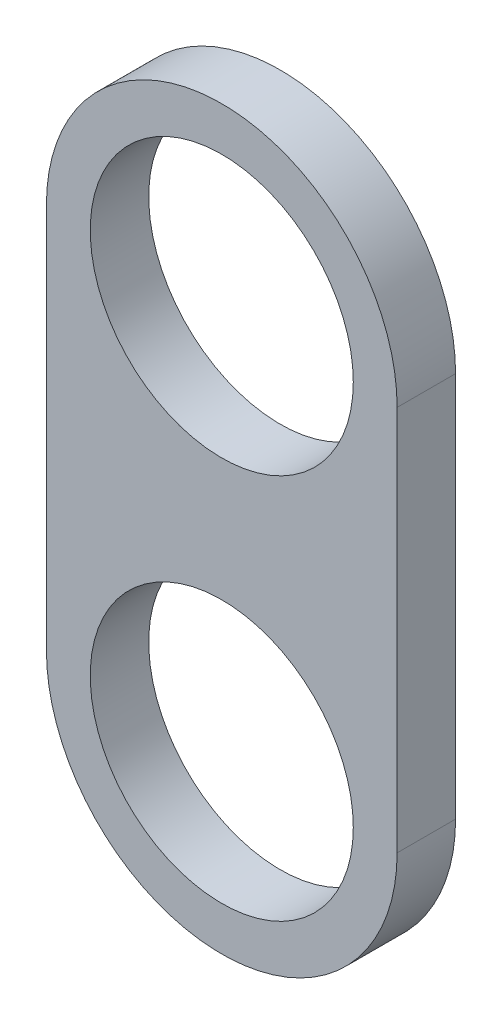
ISO-10303-21;
HEADER;
FILE_DESCRIPTION(('STEP AP214'),'2;1');
FILE_NAME('part.step','',(''),(''),'','','');
FILE_SCHEMA(('AUTOMOTIVE_DESIGN { 1 0 10303 214 1 1 1 1 }'));
ENDSEC;
DATA;
#1=APPLICATION_CONTEXT('core data for automotive mechanical design processes');
#2=APPLICATION_PROTOCOL_DEFINITION('international standard','automotive_design',2000,#1);
#3=PRODUCT_CONTEXT('',#1,'mechanical');
#4=PRODUCT('Part','Part','',(#3));
#5=PRODUCT_RELATED_PRODUCT_CATEGORY('part','',(#4));
#6=PRODUCT_DEFINITION_FORMATION('','',#4);
#7=PRODUCT_DEFINITION_CONTEXT('part definition',#1,'design');
#8=PRODUCT_DEFINITION('design','',#6,#7);
#9=PRODUCT_DEFINITION_SHAPE('','',#8);
#10=(LENGTH_UNIT() NAMED_UNIT(*) SI_UNIT(.MILLI.,.METRE.));
#11=(NAMED_UNIT(*) PLANE_ANGLE_UNIT() SI_UNIT($,.RADIAN.));
#12=(NAMED_UNIT(*) SI_UNIT($,.STERADIAN.) SOLID_ANGLE_UNIT());
#13=UNCERTAINTY_MEASURE_WITH_UNIT(LENGTH_MEASURE(1.E-05),#10,'distance_accuracy_value','');
#14=(GEOMETRIC_REPRESENTATION_CONTEXT(3) GLOBAL_UNCERTAINTY_ASSIGNED_CONTEXT((#13)) GLOBAL_UNIT_ASSIGNED_CONTEXT((#10,
#11,#12)) REPRESENTATION_CONTEXT('',''));
#15=CARTESIAN_POINT('',(0.,0.,0.));
#16=DIRECTION('',(0.,0.,1.));
#17=DIRECTION('',(1.,0.,0.));
#18=AXIS2_PLACEMENT_3D('',#15,#16,#17);
#19=CARTESIAN_POINT('',(0.,0.,6.35));
#20=DIRECTION('',(0.,0.,-1.));
#21=DIRECTION('',(-1.,0.,0.));
#22=AXIS2_PLACEMENT_3D('',#19,#20,#21);
#23=CYLINDRICAL_SURFACE('',#22,19.05);
#24=CARTESIAN_POINT('',(0.,0.,0.));
#25=DIRECTION('',(0.,0.,1.));
#26=DIRECTION('',(1.,0.,0.));
#27=AXIS2_PLACEMENT_3D('',#24,#25,#26);
#28=CIRCLE('',#27,19.05);
#29=CARTESIAN_POINT('',(-19.05,0.,0.));
#30=VERTEX_POINT('',#29);
#31=CARTESIAN_POINT('',(19.05,0.,0.));
#32=VERTEX_POINT('',#31);
#33=EDGE_CURVE('E97',#30,#32,#28,.T.);
#34=ORIENTED_EDGE('',*,*,#33,.T.);
#35=DIRECTION('',(0.,0.,-1.));
#36=VECTOR('',#35,1.);
#37=CARTESIAN_POINT('',(19.05,0.,6.35));
#38=LINE('',#37,#36);
#39=CARTESIAN_POINT('',(19.05,0.,6.35));
#40=VERTEX_POINT('',#39);
#41=EDGE_CURVE('E11',#40,#32,#38,.T.);
#42=ORIENTED_EDGE('',*,*,#41,.F.);
#43=CARTESIAN_POINT('',(0.,0.,6.35));
#44=DIRECTION('',(0.,0.,1.));
#45=DIRECTION('',(1.,0.,0.));
#46=AXIS2_PLACEMENT_3D('',#43,#44,#45);
#47=CIRCLE('',#46,19.05);
#48=CARTESIAN_POINT('',(-19.05,0.,6.35));
#49=VERTEX_POINT('',#48);
#50=EDGE_CURVE('E84',#49,#40,#47,.T.);
#51=ORIENTED_EDGE('',*,*,#50,.F.);
#52=DIRECTION('',(0.,0.,-1.));
#53=VECTOR('',#52,1.);
#54=CARTESIAN_POINT('',(-19.05,0.,6.35));
#55=LINE('',#54,#53);
#56=EDGE_CURVE('E93',#49,#30,#55,.T.);
#57=ORIENTED_EDGE('',*,*,#56,.T.);
#58=EDGE_LOOP('',(#34,#42,#51,#57));
#59=FACE_BOUND('',#58,.T.);
#60=ADVANCED_FACE('F32',(#59),#23,.T.);
#61=CARTESIAN_POINT('',(19.05,0.,6.35));
#62=DIRECTION('',(-1.,0.,0.));
#63=DIRECTION('',(0.,0.,1.));
#64=AXIS2_PLACEMENT_3D('',#61,#62,#63);
#65=PLANE('',#64);
#66=DIRECTION('',(0.,1.,0.));
#67=VECTOR('',#66,1.);
#68=CARTESIAN_POINT('',(19.05,0.,0.));
#69=LINE('',#68,#67);
#70=CARTESIAN_POINT('',(19.05,41.91,0.));
#71=VERTEX_POINT('',#70);
#72=EDGE_CURVE('E88',#32,#71,#69,.T.);
#73=ORIENTED_EDGE('',*,*,#72,.T.);
#74=DIRECTION('',(0.,0.,-1.));
#75=VECTOR('',#74,1.);
#76=CARTESIAN_POINT('',(19.05,41.91,6.35));
#77=LINE('',#76,#75);
#78=CARTESIAN_POINT('',(19.05,41.91,6.35));
#79=VERTEX_POINT('',#78);
#80=EDGE_CURVE('E41',#79,#71,#77,.T.);
#81=ORIENTED_EDGE('',*,*,#80,.F.);
#82=DIRECTION('',(0.,1.,0.));
#83=VECTOR('',#82,1.);
#84=CARTESIAN_POINT('',(19.05,0.,6.35));
#85=LINE('',#84,#83);
#86=EDGE_CURVE('E79',#40,#79,#85,.T.);
#87=ORIENTED_EDGE('',*,*,#86,.F.);
#88=ORIENTED_EDGE('',*,*,#41,.T.);
#89=EDGE_LOOP('',(#73,#81,#87,#88));
#90=FACE_BOUND('',#89,.T.);
#91=ADVANCED_FACE('F87',(#90),#65,.F.);
#92=CARTESIAN_POINT('',(0.,41.91,6.35));
#93=DIRECTION('',(0.,0.,-1.));
#94=DIRECTION('',(-1.,0.,0.));
#95=AXIS2_PLACEMENT_3D('',#92,#93,#94);
#96=CYLINDRICAL_SURFACE('',#95,19.05);
#97=CARTESIAN_POINT('',(0.,41.91,0.));
#98=DIRECTION('',(0.,0.,1.));
#99=DIRECTION('',(1.,0.,0.));
#100=AXIS2_PLACEMENT_3D('',#97,#98,#99);
#101=CIRCLE('',#100,19.05);
#102=CARTESIAN_POINT('',(-19.05,41.91,0.));
#103=VERTEX_POINT('',#102);
#104=EDGE_CURVE('E66',#71,#103,#101,.T.);
#105=ORIENTED_EDGE('',*,*,#104,.T.);
#106=DIRECTION('',(0.,0.,-1.));
#107=VECTOR('',#106,1.);
#108=CARTESIAN_POINT('',(-19.05,41.91,6.35));
#109=LINE('',#108,#107);
#110=CARTESIAN_POINT('',(-19.05,41.91,6.35));
#111=VERTEX_POINT('',#110);
#112=EDGE_CURVE('E89',#111,#103,#109,.T.);
#113=ORIENTED_EDGE('',*,*,#112,.F.);
#114=CARTESIAN_POINT('',(0.,41.91,6.35));
#115=DIRECTION('',(0.,0.,1.));
#116=DIRECTION('',(1.,0.,0.));
#117=AXIS2_PLACEMENT_3D('',#114,#115,#116);
#118=CIRCLE('',#117,19.05);
#119=EDGE_CURVE('E82',#79,#111,#118,.T.);
#120=ORIENTED_EDGE('',*,*,#119,.F.);
#121=ORIENTED_EDGE('',*,*,#80,.T.);
#122=EDGE_LOOP('',(#105,#113,#120,#121));
#123=FACE_BOUND('',#122,.T.);
#124=ADVANCED_FACE('F91',(#123),#96,.T.);
#125=CARTESIAN_POINT('',(-19.05,0.,6.35));
#126=DIRECTION('',(1.,0.,0.));
#127=DIRECTION('',(0.,0.,-1.));
#128=AXIS2_PLACEMENT_3D('',#125,#126,#127);
#129=PLANE('',#128);
#130=DIRECTION('',(0.,-1.,0.));
#131=VECTOR('',#130,1.);
#132=CARTESIAN_POINT('',(-19.05,0.,0.));
#133=LINE('',#132,#131);
#134=EDGE_CURVE('E72',#103,#30,#133,.T.);
#135=ORIENTED_EDGE('',*,*,#134,.T.);
#136=ORIENTED_EDGE('',*,*,#56,.F.);
#137=DIRECTION('',(0.,-1.,0.));
#138=VECTOR('',#137,1.);
#139=CARTESIAN_POINT('',(-19.05,0.,6.35));
#140=LINE('',#139,#138);
#141=EDGE_CURVE('E49',#111,#49,#140,.T.);
#142=ORIENTED_EDGE('',*,*,#141,.F.);
#143=ORIENTED_EDGE('',*,*,#112,.T.);
#144=EDGE_LOOP('',(#135,#136,#142,#143));
#145=FACE_BOUND('',#144,.T.);
#146=ADVANCED_FACE('F105',(#145),#129,.F.);
#147=CARTESIAN_POINT('',(0.,0.,6.35));
#148=DIRECTION('',(0.,0.,1.));
#149=DIRECTION('',(1.,0.,0.));
#150=AXIS2_PLACEMENT_3D('',#147,#148,#149);
#151=PLANE('',#150);
#152=CARTESIAN_POINT('',(0.,41.91,6.35));
#153=DIRECTION('',(0.,0.,1.));
#154=DIRECTION('',(1.,0.,0.));
#155=AXIS2_PLACEMENT_3D('',#152,#153,#154);
#156=CIRCLE('',#155,14.2875);
#157=CARTESIAN_POINT('',(14.2875,41.91,6.35));
#158=VERTEX_POINT('',#157);
#159=EDGE_CURVE('E116',#158,#158,#156,.T.);
#160=ORIENTED_EDGE('',*,*,#159,.F.);
#161=EDGE_LOOP('',(#160));
#162=FACE_BOUND('',#161,.T.);
#163=CARTESIAN_POINT('',(0.,0.,6.35));
#164=DIRECTION('',(0.,0.,1.));
#165=DIRECTION('',(1.,0.,0.));
#166=AXIS2_PLACEMENT_3D('',#163,#164,#165);
#167=CIRCLE('',#166,14.2875);
#168=CARTESIAN_POINT('',(14.2875,0.,6.35));
#169=VERTEX_POINT('',#168);
#170=EDGE_CURVE('E113',#169,#169,#167,.T.);
#171=ORIENTED_EDGE('',*,*,#170,.F.);
#172=EDGE_LOOP('',(#171));
#173=FACE_BOUND('',#172,.T.);
#174=ORIENTED_EDGE('',*,*,#50,.T.);
#175=ORIENTED_EDGE('',*,*,#86,.T.);
#176=ORIENTED_EDGE('',*,*,#119,.T.);
#177=ORIENTED_EDGE('',*,*,#141,.T.);
#178=EDGE_LOOP('',(#174,#175,#176,#177));
#179=FACE_BOUND('',#178,.T.);
#180=ADVANCED_FACE('F80',(#162,#173,#179),#151,.T.);
#181=CARTESIAN_POINT('',(0.,0.,0.));
#182=DIRECTION('',(0.,0.,1.));
#183=DIRECTION('',(1.,0.,0.));
#184=AXIS2_PLACEMENT_3D('',#181,#182,#183);
#185=PLANE('',#184);
#186=CARTESIAN_POINT('',(0.,41.91,0.));
#187=DIRECTION('',(0.,0.,1.));
#188=DIRECTION('',(1.,0.,0.));
#189=AXIS2_PLACEMENT_3D('',#186,#187,#188);
#190=CIRCLE('',#189,14.2875);
#191=CARTESIAN_POINT('',(14.2875,41.91,0.));
#192=VERTEX_POINT('',#191);
#193=EDGE_CURVE('E35',#192,#192,#190,.T.);
#194=ORIENTED_EDGE('',*,*,#193,.T.);
#195=EDGE_LOOP('',(#194));
#196=FACE_BOUND('',#195,.T.);
#197=CARTESIAN_POINT('',(0.,0.,0.));
#198=DIRECTION('',(0.,0.,1.));
#199=DIRECTION('',(1.,0.,0.));
#200=AXIS2_PLACEMENT_3D('',#197,#198,#199);
#201=CIRCLE('',#200,14.2875);
#202=CARTESIAN_POINT('',(14.2875,0.,0.));
#203=VERTEX_POINT('',#202);
#204=EDGE_CURVE('E100',#203,#203,#201,.T.);
#205=ORIENTED_EDGE('',*,*,#204,.T.);
#206=EDGE_LOOP('',(#205));
#207=FACE_BOUND('',#206,.T.);
#208=ORIENTED_EDGE('',*,*,#33,.F.);
#209=ORIENTED_EDGE('',*,*,#134,.F.);
#210=ORIENTED_EDGE('',*,*,#104,.F.);
#211=ORIENTED_EDGE('',*,*,#72,.F.);
#212=EDGE_LOOP('',(#208,#209,#210,#211));
#213=FACE_BOUND('',#212,.T.);
#214=ADVANCED_FACE('F108',(#196,#207,#213),#185,.F.);
#215=CARTESIAN_POINT('',(0.,0.,6.35));
#216=DIRECTION('',(0.,0.,1.));
#217=DIRECTION('',(1.,0.,0.));
#218=AXIS2_PLACEMENT_3D('',#215,#216,#217);
#219=CYLINDRICAL_SURFACE('',#218,14.2875);
#220=ORIENTED_EDGE('',*,*,#170,.T.);
#221=EDGE_LOOP('',(#220));
#222=FACE_BOUND('',#221,.T.);
#223=ORIENTED_EDGE('',*,*,#204,.F.);
#224=EDGE_LOOP('',(#223));
#225=FACE_BOUND('',#224,.T.);
#226=ADVANCED_FACE('F127',(#222,#225),#219,.F.);
#227=CARTESIAN_POINT('',(0.,41.91,6.35));
#228=DIRECTION('',(0.,0.,1.));
#229=DIRECTION('',(1.,0.,0.));
#230=AXIS2_PLACEMENT_3D('',#227,#228,#229);
#231=CYLINDRICAL_SURFACE('',#230,14.2875);
#232=ORIENTED_EDGE('',*,*,#159,.T.);
#233=EDGE_LOOP('',(#232));
#234=FACE_BOUND('',#233,.T.);
#235=ORIENTED_EDGE('',*,*,#193,.F.);
#236=EDGE_LOOP('',(#235));
#237=FACE_BOUND('',#236,.T.);
#238=ADVANCED_FACE('F125',(#234,#237),#231,.F.);
#239=CLOSED_SHELL('',(#60,#91,#124,#146,#180,#214,#226,#238));
#240=MANIFOLD_SOLID_BREP('B2',#239);
#241=ADVANCED_BREP_SHAPE_REPRESENTATION('',(#18,#240),#14);
#242=SHAPE_DEFINITION_REPRESENTATION(#9,#241);
ENDSEC;
END-ISO-10303-21;
